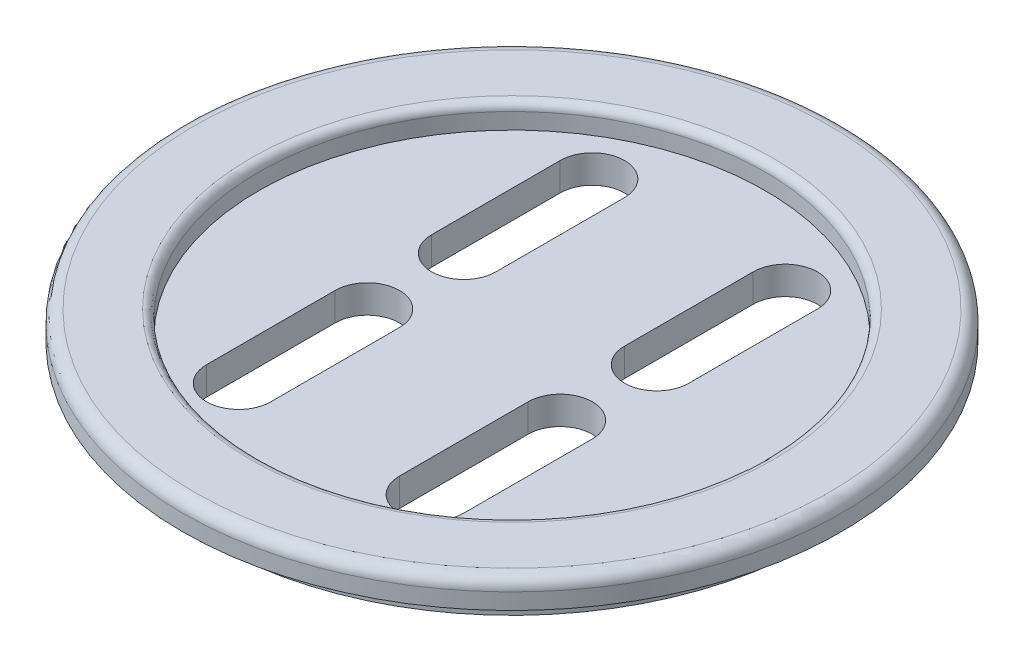
ISO-10303-21;
HEADER;
FILE_DESCRIPTION(('STEP AP214'),'2;1');
FILE_NAME('part.step','',(''),(''),'','','');
FILE_SCHEMA(('AUTOMOTIVE_DESIGN { 1 0 10303 214 1 1 1 1 }'));
ENDSEC;
DATA;
#1=APPLICATION_CONTEXT('core data for automotive mechanical design processes');
#2=APPLICATION_PROTOCOL_DEFINITION('international standard','automotive_design',2000,#1);
#3=PRODUCT_CONTEXT('',#1,'mechanical');
#4=PRODUCT('Part','Part','',(#3));
#5=PRODUCT_RELATED_PRODUCT_CATEGORY('part','',(#4));
#6=PRODUCT_DEFINITION_FORMATION('','',#4);
#7=PRODUCT_DEFINITION_CONTEXT('part definition',#1,'design');
#8=PRODUCT_DEFINITION('design','',#6,#7);
#9=PRODUCT_DEFINITION_SHAPE('','',#8);
#10=(LENGTH_UNIT() NAMED_UNIT(*) SI_UNIT(.MILLI.,.METRE.));
#11=(NAMED_UNIT(*) PLANE_ANGLE_UNIT() SI_UNIT($,.RADIAN.));
#12=(NAMED_UNIT(*) SI_UNIT($,.STERADIAN.) SOLID_ANGLE_UNIT());
#13=UNCERTAINTY_MEASURE_WITH_UNIT(LENGTH_MEASURE(1.E-05),#10,'distance_accuracy_value','');
#14=(GEOMETRIC_REPRESENTATION_CONTEXT(3) GLOBAL_UNCERTAINTY_ASSIGNED_CONTEXT((#13)) GLOBAL_UNIT_ASSIGNED_CONTEXT((#10,
#11,#12)) REPRESENTATION_CONTEXT('',''));
#15=CARTESIAN_POINT('',(0.,0.,0.));
#16=DIRECTION('',(0.,0.,1.));
#17=DIRECTION('',(1.,0.,0.));
#18=AXIS2_PLACEMENT_3D('',#15,#16,#17);
#19=CARTESIAN_POINT('',(160.,-30.,220.));
#20=DIRECTION('',(1.,0.,0.));
#21=DIRECTION('',(0.,0.,-1.));
#22=AXIS2_PLACEMENT_3D('',#19,#20,#21);
#23=PLANE('',#22);
#24=DIRECTION('',(0.,0.,1.));
#25=VECTOR('',#24,1.);
#26=CARTESIAN_POINT('',(160.,5.00000000000015,220.));
#27=LINE('',#26,#25);
#28=CARTESIAN_POINT('',(160.,5.00000000000015,60.));
#29=VERTEX_POINT('',#28);
#30=CARTESIAN_POINT('',(160.,5.00000000000015,220.));
#31=VERTEX_POINT('',#30);
#32=EDGE_CURVE('E296',#29,#31,#27,.T.);
#33=ORIENTED_EDGE('',*,*,#32,.F.);
#34=DIRECTION('',(0.,1.,0.));
#35=VECTOR('',#34,1.);
#36=CARTESIAN_POINT('',(160.,-30.,60.));
#37=LINE('',#36,#35);
#38=CARTESIAN_POINT('',(160.,-30.,60.));
#39=VERTEX_POINT('',#38);
#40=EDGE_CURVE('E201',#39,#29,#37,.T.);
#41=ORIENTED_EDGE('',*,*,#40,.F.);
#42=DIRECTION('',(0.,0.,-1.));
#43=VECTOR('',#42,1.);
#44=CARTESIAN_POINT('',(160.,-30.,220.));
#45=LINE('',#44,#43);
#46=CARTESIAN_POINT('',(160.,-30.,220.));
#47=VERTEX_POINT('',#46);
#48=EDGE_CURVE('E188',#47,#39,#45,.T.);
#49=ORIENTED_EDGE('',*,*,#48,.F.);
#50=DIRECTION('',(0.,1.,0.));
#51=VECTOR('',#50,1.);
#52=CARTESIAN_POINT('',(160.,-30.,220.));
#53=LINE('',#52,#51);
#54=EDGE_CURVE('E202',#47,#31,#53,.T.);
#55=ORIENTED_EDGE('',*,*,#54,.T.);
#56=EDGE_LOOP('',(#33,#41,#49,#55));
#57=FACE_BOUND('',#56,.T.);
#58=ADVANCED_FACE('F33',(#57),#23,.F.);
#59=CARTESIAN_POINT('',(120.,-30.,220.));
#60=DIRECTION('',(0.,1.,0.));
#61=DIRECTION('',(0.,0.,1.));
#62=AXIS2_PLACEMENT_3D('',#59,#60,#61);
#63=CYLINDRICAL_SURFACE('',#62,39.9999999999999);
#64=CARTESIAN_POINT('',(120.,5.00000000000015,220.));
#65=DIRECTION('',(0.,1.,0.));
#66=DIRECTION('',(0.,0.,1.));
#67=AXIS2_PLACEMENT_3D('',#64,#65,#66);
#68=CIRCLE('',#67,39.9999999999999);
#69=CARTESIAN_POINT('',(80.0000000000001,5.00000000000015,220.));
#70=VERTEX_POINT('',#69);
#71=EDGE_CURVE('E298',#31,#70,#68,.F.);
#72=ORIENTED_EDGE('',*,*,#71,.F.);
#73=ORIENTED_EDGE('',*,*,#54,.F.);
#74=CARTESIAN_POINT('',(120.,-30.,220.));
#75=DIRECTION('',(0.,1.,0.));
#76=DIRECTION('',(0.,0.,1.));
#77=AXIS2_PLACEMENT_3D('',#74,#75,#76);
#78=CIRCLE('',#77,39.9999999999999);
#79=CARTESIAN_POINT('',(80.0000000000001,-30.,220.));
#80=VERTEX_POINT('',#79);
#81=EDGE_CURVE('E198',#80,#47,#78,.T.);
#82=ORIENTED_EDGE('',*,*,#81,.F.);
#83=DIRECTION('',(0.,1.,0.));
#84=VECTOR('',#83,1.);
#85=CARTESIAN_POINT('',(80.0000000000001,-30.,220.));
#86=LINE('',#85,#84);
#87=EDGE_CURVE('E206',#80,#70,#86,.T.);
#88=ORIENTED_EDGE('',*,*,#87,.T.);
#89=EDGE_LOOP('',(#72,#73,#82,#88));
#90=FACE_BOUND('',#89,.T.);
#91=ADVANCED_FACE('F240',(#90),#63,.F.);
#92=CARTESIAN_POINT('',(80.0000000000001,-30.,220.));
#93=DIRECTION('',(1.,0.,0.));
#94=DIRECTION('',(0.,0.,-1.));
#95=AXIS2_PLACEMENT_3D('',#92,#93,#94);
#96=PLANE('',#95);
#97=DIRECTION('',(0.,1.,0.));
#98=VECTOR('',#97,1.);
#99=CARTESIAN_POINT('',(80.0000000000001,-30.,60.));
#100=LINE('',#99,#98);
#101=CARTESIAN_POINT('',(80.0000000000001,-30.,60.));
#102=VERTEX_POINT('',#101);
#103=CARTESIAN_POINT('',(80.0000000000001,5.00000000000013,60.));
#104=VERTEX_POINT('',#103);
#105=EDGE_CURVE('E209',#102,#104,#100,.T.);
#106=ORIENTED_EDGE('',*,*,#105,.T.);
#107=DIRECTION('',(0.,0.,1.));
#108=VECTOR('',#107,1.);
#109=CARTESIAN_POINT('',(80.0000000000001,5.00000000000015,220.));
#110=LINE('',#109,#108);
#111=EDGE_CURVE('E48',#104,#70,#110,.T.);
#112=ORIENTED_EDGE('',*,*,#111,.T.);
#113=ORIENTED_EDGE('',*,*,#87,.F.);
#114=DIRECTION('',(0.,0.,-1.));
#115=VECTOR('',#114,1.);
#116=CARTESIAN_POINT('',(80.0000000000001,-30.,220.));
#117=LINE('',#116,#115);
#118=EDGE_CURVE('E195',#80,#102,#117,.T.);
#119=ORIENTED_EDGE('',*,*,#118,.T.);
#120=EDGE_LOOP('',(#106,#112,#113,#119));
#121=FACE_BOUND('',#120,.T.);
#122=ADVANCED_FACE('F246',(#121),#96,.T.);
#123=CARTESIAN_POINT('',(120.,-30.,60.));
#124=DIRECTION('',(0.,1.,0.));
#125=DIRECTION('',(0.,0.,1.));
#126=AXIS2_PLACEMENT_3D('',#123,#124,#125);
#127=CYLINDRICAL_SURFACE('',#126,40.);
#128=CARTESIAN_POINT('',(120.,5.00000000000015,60.));
#129=DIRECTION('',(0.,1.,0.));
#130=DIRECTION('',(0.,0.,1.));
#131=AXIS2_PLACEMENT_3D('',#128,#129,#130);
#132=CIRCLE('',#131,40.);
#133=EDGE_CURVE('E345',#104,#29,#132,.F.);
#134=ORIENTED_EDGE('',*,*,#133,.F.);
#135=ORIENTED_EDGE('',*,*,#105,.F.);
#136=CARTESIAN_POINT('',(120.,-30.,60.));
#137=DIRECTION('',(0.,1.,0.));
#138=DIRECTION('',(0.,0.,1.));
#139=AXIS2_PLACEMENT_3D('',#136,#137,#138);
#140=CIRCLE('',#139,40.);
#141=EDGE_CURVE('E191',#39,#102,#140,.T.);
#142=ORIENTED_EDGE('',*,*,#141,.F.);
#143=ORIENTED_EDGE('',*,*,#40,.T.);
#144=EDGE_LOOP('',(#134,#135,#142,#143));
#145=FACE_BOUND('',#144,.T.);
#146=ADVANCED_FACE('F252',(#145),#127,.F.);
#147=CARTESIAN_POINT('',(-160.,-30.,220.));
#148=DIRECTION('',(1.,0.,0.));
#149=DIRECTION('',(0.,0.,-1.));
#150=AXIS2_PLACEMENT_3D('',#147,#148,#149);
#151=PLANE('',#150);
#152=DIRECTION('',(0.,1.,0.));
#153=VECTOR('',#152,1.);
#154=CARTESIAN_POINT('',(-160.,-30.,60.));
#155=LINE('',#154,#153);
#156=CARTESIAN_POINT('',(-160.,-30.,60.));
#157=VERTEX_POINT('',#156);
#158=CARTESIAN_POINT('',(-160.,5.00000000000015,60.));
#159=VERTEX_POINT('',#158);
#160=EDGE_CURVE('E303',#157,#159,#155,.T.);
#161=ORIENTED_EDGE('',*,*,#160,.T.);
#162=DIRECTION('',(0.,0.,1.));
#163=VECTOR('',#162,1.);
#164=CARTESIAN_POINT('',(-160.,5.00000000000015,220.));
#165=LINE('',#164,#163);
#166=CARTESIAN_POINT('',(-160.,5.00000000000015,220.));
#167=VERTEX_POINT('',#166);
#168=EDGE_CURVE('E347',#159,#167,#165,.T.);
#169=ORIENTED_EDGE('',*,*,#168,.T.);
#170=DIRECTION('',(0.,1.,0.));
#171=VECTOR('',#170,1.);
#172=CARTESIAN_POINT('',(-160.,-30.,220.));
#173=LINE('',#172,#171);
#174=CARTESIAN_POINT('',(-160.,-30.,220.));
#175=VERTEX_POINT('',#174);
#176=EDGE_CURVE('E332',#175,#167,#173,.T.);
#177=ORIENTED_EDGE('',*,*,#176,.F.);
#178=DIRECTION('',(0.,0.,-1.));
#179=VECTOR('',#178,1.);
#180=CARTESIAN_POINT('',(-160.,-30.,220.));
#181=LINE('',#180,#179);
#182=EDGE_CURVE('E192',#175,#157,#181,.T.);
#183=ORIENTED_EDGE('',*,*,#182,.T.);
#184=EDGE_LOOP('',(#161,#169,#177,#183));
#185=FACE_BOUND('',#184,.T.);
#186=ADVANCED_FACE('F377',(#185),#151,.T.);
#187=CARTESIAN_POINT('',(-120.,-30.,60.));
#188=DIRECTION('',(0.,1.,0.));
#189=DIRECTION('',(0.,0.,1.));
#190=AXIS2_PLACEMENT_3D('',#187,#188,#189);
#191=CYLINDRICAL_SURFACE('',#190,40.);
#192=DIRECTION('',(0.,1.,0.));
#193=VECTOR('',#192,1.);
#194=CARTESIAN_POINT('',(-80.0000000000001,-30.,60.));
#195=LINE('',#194,#193);
#196=CARTESIAN_POINT('',(-80.0000000000001,-30.,60.));
#197=VERTEX_POINT('',#196);
#198=CARTESIAN_POINT('',(-80.,5.00000000000015,60.));
#199=VERTEX_POINT('',#198);
#200=EDGE_CURVE('E338',#197,#199,#195,.T.);
#201=ORIENTED_EDGE('',*,*,#200,.T.);
#202=CARTESIAN_POINT('',(-120.,5.00000000000015,60.));
#203=DIRECTION('',(0.,1.,0.));
#204=DIRECTION('',(0.,0.,1.));
#205=AXIS2_PLACEMENT_3D('',#202,#203,#204);
#206=CIRCLE('',#205,40.);
#207=EDGE_CURVE('E350',#199,#159,#206,.T.);
#208=ORIENTED_EDGE('',*,*,#207,.T.);
#209=ORIENTED_EDGE('',*,*,#160,.F.);
#210=CARTESIAN_POINT('',(-120.,-30.,60.));
#211=DIRECTION('',(0.,-1.,0.));
#212=DIRECTION('',(0.,0.,-1.));
#213=AXIS2_PLACEMENT_3D('',#210,#211,#212);
#214=CIRCLE('',#213,40.);
#215=EDGE_CURVE('E325',#157,#197,#214,.T.);
#216=ORIENTED_EDGE('',*,*,#215,.T.);
#217=EDGE_LOOP('',(#201,#208,#209,#216));
#218=FACE_BOUND('',#217,.T.);
#219=ADVANCED_FACE('F380',(#218),#191,.F.);
#220=CARTESIAN_POINT('',(-80.0000000000001,-30.,220.));
#221=DIRECTION('',(1.,0.,0.));
#222=DIRECTION('',(0.,0.,-1.));
#223=AXIS2_PLACEMENT_3D('',#220,#221,#222);
#224=PLANE('',#223);
#225=DIRECTION('',(0.,0.,1.));
#226=VECTOR('',#225,1.);
#227=CARTESIAN_POINT('',(-80.0000000000001,5.00000000000015,220.));
#228=LINE('',#227,#226);
#229=CARTESIAN_POINT('',(-80.0000000000001,5.00000000000013,220.));
#230=VERTEX_POINT('',#229);
#231=EDGE_CURVE('E56',#199,#230,#228,.T.);
#232=ORIENTED_EDGE('',*,*,#231,.F.);
#233=ORIENTED_EDGE('',*,*,#200,.F.);
#234=DIRECTION('',(0.,0.,-1.));
#235=VECTOR('',#234,1.);
#236=CARTESIAN_POINT('',(-80.0000000000001,-30.,220.));
#237=LINE('',#236,#235);
#238=CARTESIAN_POINT('',(-80.0000000000001,-30.,220.));
#239=VERTEX_POINT('',#238);
#240=EDGE_CURVE('E327',#239,#197,#237,.T.);
#241=ORIENTED_EDGE('',*,*,#240,.F.);
#242=DIRECTION('',(0.,1.,0.));
#243=VECTOR('',#242,1.);
#244=CARTESIAN_POINT('',(-80.0000000000001,-30.,220.));
#245=LINE('',#244,#243);
#246=EDGE_CURVE('E335',#239,#230,#245,.T.);
#247=ORIENTED_EDGE('',*,*,#246,.T.);
#248=EDGE_LOOP('',(#232,#233,#241,#247));
#249=FACE_BOUND('',#248,.T.);
#250=ADVANCED_FACE('F384',(#249),#224,.F.);
#251=CARTESIAN_POINT('',(-120.,-30.,220.));
#252=DIRECTION('',(0.,1.,0.));
#253=DIRECTION('',(0.,0.,1.));
#254=AXIS2_PLACEMENT_3D('',#251,#252,#253);
#255=CYLINDRICAL_SURFACE('',#254,39.9999999999999);
#256=ORIENTED_EDGE('',*,*,#176,.T.);
#257=CARTESIAN_POINT('',(-120.,5.00000000000015,220.));
#258=DIRECTION('',(0.,1.,0.));
#259=DIRECTION('',(0.,0.,1.));
#260=AXIS2_PLACEMENT_3D('',#257,#258,#259);
#261=CIRCLE('',#260,39.9999999999999);
#262=EDGE_CURVE('E354',#167,#230,#261,.T.);
#263=ORIENTED_EDGE('',*,*,#262,.T.);
#264=ORIENTED_EDGE('',*,*,#246,.F.);
#265=CARTESIAN_POINT('',(-120.,-30.,220.));
#266=DIRECTION('',(0.,-1.,0.));
#267=DIRECTION('',(0.,0.,-1.));
#268=AXIS2_PLACEMENT_3D('',#265,#266,#267);
#269=CIRCLE('',#268,39.9999999999999);
#270=EDGE_CURVE('E330',#239,#175,#269,.T.);
#271=ORIENTED_EDGE('',*,*,#270,.T.);
#272=EDGE_LOOP('',(#256,#263,#264,#271));
#273=FACE_BOUND('',#272,.T.);
#274=ADVANCED_FACE('F388',(#273),#255,.F.);
#275=CARTESIAN_POINT('',(-80.0000000000001,-30.,-220.));
#276=DIRECTION('',(-1.,0.,0.));
#277=DIRECTION('',(0.,0.,1.));
#278=AXIS2_PLACEMENT_3D('',#275,#276,#277);
#279=PLANE('',#278);
#280=DIRECTION('',(0.,1.,0.));
#281=VECTOR('',#280,1.);
#282=CARTESIAN_POINT('',(-80.0000000000001,-30.,-60.));
#283=LINE('',#282,#281);
#284=CARTESIAN_POINT('',(-80.0000000000001,-30.,-60.));
#285=VERTEX_POINT('',#284);
#286=CARTESIAN_POINT('',(-80.0000000000001,5.00000000000015,-60.));
#287=VERTEX_POINT('',#286);
#288=EDGE_CURVE('E187',#285,#287,#283,.T.);
#289=ORIENTED_EDGE('',*,*,#288,.T.);
#290=DIRECTION('',(0.,0.,-1.));
#291=VECTOR('',#290,1.);
#292=CARTESIAN_POINT('',(-80.0000000000001,5.00000000000015,-220.));
#293=LINE('',#292,#291);
#294=CARTESIAN_POINT('',(-80.0000000000001,5.00000000000015,-220.));
#295=VERTEX_POINT('',#294);
#296=EDGE_CURVE('E356',#287,#295,#293,.T.);
#297=ORIENTED_EDGE('',*,*,#296,.T.);
#298=DIRECTION('',(0.,1.,0.));
#299=VECTOR('',#298,1.);
#300=CARTESIAN_POINT('',(-80.0000000000001,-30.,-220.));
#301=LINE('',#300,#299);
#302=CARTESIAN_POINT('',(-80.0000000000001,-30.,-220.));
#303=VERTEX_POINT('',#302);
#304=EDGE_CURVE('E313',#303,#295,#301,.T.);
#305=ORIENTED_EDGE('',*,*,#304,.F.);
#306=DIRECTION('',(0.,0.,1.));
#307=VECTOR('',#306,1.);
#308=CARTESIAN_POINT('',(-80.0000000000001,-30.,-220.));
#309=LINE('',#308,#307);
#310=EDGE_CURVE('E301',#303,#285,#309,.T.);
#311=ORIENTED_EDGE('',*,*,#310,.T.);
#312=EDGE_LOOP('',(#289,#297,#305,#311));
#313=FACE_BOUND('',#312,.T.);
#314=ADVANCED_FACE('F392',(#313),#279,.T.);
#315=CARTESIAN_POINT('',(-120.,-30.,-60.));
#316=DIRECTION('',(0.,1.,0.));
#317=DIRECTION('',(0.,0.,1.));
#318=AXIS2_PLACEMENT_3D('',#315,#316,#317);
#319=CYLINDRICAL_SURFACE('',#318,40.);
#320=CARTESIAN_POINT('',(-120.,5.00000000000015,-60.));
#321=DIRECTION('',(0.,1.,0.));
#322=DIRECTION('',(0.,0.,1.));
#323=AXIS2_PLACEMENT_3D('',#320,#321,#322);
#324=CIRCLE('',#323,40.);
#325=CARTESIAN_POINT('',(-160.,5.00000000000015,-60.));
#326=VERTEX_POINT('',#325);
#327=EDGE_CURVE('E359',#287,#326,#324,.F.);
#328=ORIENTED_EDGE('',*,*,#327,.F.);
#329=ORIENTED_EDGE('',*,*,#288,.F.);
#330=CARTESIAN_POINT('',(-120.,-30.,-60.));
#331=DIRECTION('',(0.,1.,0.));
#332=DIRECTION('',(0.,0.,1.));
#333=AXIS2_PLACEMENT_3D('',#330,#331,#332);
#334=CIRCLE('',#333,40.);
#335=CARTESIAN_POINT('',(-160.,-30.,-60.));
#336=VERTEX_POINT('',#335);
#337=EDGE_CURVE('E304',#336,#285,#334,.T.);
#338=ORIENTED_EDGE('',*,*,#337,.F.);
#339=DIRECTION('',(0.,1.,0.));
#340=VECTOR('',#339,1.);
#341=CARTESIAN_POINT('',(-160.,-30.,-60.));
#342=LINE('',#341,#340);
#343=EDGE_CURVE('E319',#336,#326,#342,.T.);
#344=ORIENTED_EDGE('',*,*,#343,.T.);
#345=EDGE_LOOP('',(#328,#329,#338,#344));
#346=FACE_BOUND('',#345,.T.);
#347=ADVANCED_FACE('F396',(#346),#319,.F.);
#348=CARTESIAN_POINT('',(-160.,-30.,-220.));
#349=DIRECTION('',(-1.,0.,0.));
#350=DIRECTION('',(0.,0.,1.));
#351=AXIS2_PLACEMENT_3D('',#348,#349,#350);
#352=PLANE('',#351);
#353=DIRECTION('',(0.,0.,-1.));
#354=VECTOR('',#353,1.);
#355=CARTESIAN_POINT('',(-160.,5.00000000000015,-220.));
#356=LINE('',#355,#354);
#357=CARTESIAN_POINT('',(-160.,5.00000000000013,-220.));
#358=VERTEX_POINT('',#357);
#359=EDGE_CURVE('E361',#326,#358,#356,.T.);
#360=ORIENTED_EDGE('',*,*,#359,.F.);
#361=ORIENTED_EDGE('',*,*,#343,.F.);
#362=DIRECTION('',(0.,0.,1.));
#363=VECTOR('',#362,1.);
#364=CARTESIAN_POINT('',(-160.,-30.,-220.));
#365=LINE('',#364,#363);
#366=CARTESIAN_POINT('',(-160.,-30.,-220.));
#367=VERTEX_POINT('',#366);
#368=EDGE_CURVE('E307',#367,#336,#365,.T.);
#369=ORIENTED_EDGE('',*,*,#368,.F.);
#370=DIRECTION('',(0.,1.,0.));
#371=VECTOR('',#370,1.);
#372=CARTESIAN_POINT('',(-160.,-30.,-220.));
#373=LINE('',#372,#371);
#374=EDGE_CURVE('E316',#367,#358,#373,.T.);
#375=ORIENTED_EDGE('',*,*,#374,.T.);
#376=EDGE_LOOP('',(#360,#361,#369,#375));
#377=FACE_BOUND('',#376,.T.);
#378=ADVANCED_FACE('F400',(#377),#352,.F.);
#379=CARTESIAN_POINT('',(-120.,-30.,-220.));
#380=DIRECTION('',(0.,1.,0.));
#381=DIRECTION('',(0.,0.,1.));
#382=AXIS2_PLACEMENT_3D('',#379,#380,#381);
#383=CYLINDRICAL_SURFACE('',#382,39.9999999999999);
#384=CARTESIAN_POINT('',(-120.,5.00000000000015,-220.));
#385=DIRECTION('',(0.,1.,0.));
#386=DIRECTION('',(0.,0.,1.));
#387=AXIS2_PLACEMENT_3D('',#384,#385,#386);
#388=CIRCLE('',#387,39.9999999999999);
#389=EDGE_CURVE('E166',#358,#295,#388,.F.);
#390=ORIENTED_EDGE('',*,*,#389,.F.);
#391=ORIENTED_EDGE('',*,*,#374,.F.);
#392=CARTESIAN_POINT('',(-120.,-30.,-220.));
#393=DIRECTION('',(0.,1.,0.));
#394=DIRECTION('',(0.,0.,1.));
#395=AXIS2_PLACEMENT_3D('',#392,#393,#394);
#396=CIRCLE('',#395,39.9999999999999);
#397=EDGE_CURVE('E310',#303,#367,#396,.T.);
#398=ORIENTED_EDGE('',*,*,#397,.F.);
#399=ORIENTED_EDGE('',*,*,#304,.T.);
#400=EDGE_LOOP('',(#390,#391,#398,#399));
#401=FACE_BOUND('',#400,.T.);
#402=ADVANCED_FACE('F404',(#401),#383,.F.);
#403=CARTESIAN_POINT('',(120.,-30.,-220.));
#404=DIRECTION('',(0.,1.,0.));
#405=DIRECTION('',(0.,0.,1.));
#406=AXIS2_PLACEMENT_3D('',#403,#404,#405);
#407=CYLINDRICAL_SURFACE('',#406,39.9999999999999);
#408=DIRECTION('',(0.,1.,0.));
#409=VECTOR('',#408,1.);
#410=CARTESIAN_POINT('',(160.,-30.,-220.));
#411=LINE('',#410,#409);
#412=CARTESIAN_POINT('',(160.,-30.,-220.));
#413=VERTEX_POINT('',#412);
#414=CARTESIAN_POINT('',(160.,5.00000000000015,-220.));
#415=VERTEX_POINT('',#414);
#416=EDGE_CURVE('E165',#413,#415,#411,.T.);
#417=ORIENTED_EDGE('',*,*,#416,.T.);
#418=CARTESIAN_POINT('',(120.,5.00000000000015,-220.));
#419=DIRECTION('',(0.,1.,0.));
#420=DIRECTION('',(0.,0.,1.));
#421=AXIS2_PLACEMENT_3D('',#418,#419,#420);
#422=CIRCLE('',#421,39.9999999999999);
#423=CARTESIAN_POINT('',(80.0000000000001,5.00000000000015,-220.));
#424=VERTEX_POINT('',#423);
#425=EDGE_CURVE('E149',#415,#424,#422,.T.);
#426=ORIENTED_EDGE('',*,*,#425,.T.);
#427=DIRECTION('',(0.,1.,0.));
#428=VECTOR('',#427,1.);
#429=CARTESIAN_POINT('',(80.0000000000001,-30.,-220.));
#430=LINE('',#429,#428);
#431=CARTESIAN_POINT('',(80.0000000000001,-30.,-220.));
#432=VERTEX_POINT('',#431);
#433=EDGE_CURVE('E162',#432,#424,#430,.T.);
#434=ORIENTED_EDGE('',*,*,#433,.F.);
#435=CARTESIAN_POINT('',(120.,-30.,-220.));
#436=DIRECTION('',(0.,-1.,0.));
#437=DIRECTION('',(0.,0.,-1.));
#438=AXIS2_PLACEMENT_3D('',#435,#436,#437);
#439=CIRCLE('',#438,39.9999999999999);
#440=EDGE_CURVE('E185',#432,#413,#439,.T.);
#441=ORIENTED_EDGE('',*,*,#440,.T.);
#442=EDGE_LOOP('',(#417,#426,#434,#441));
#443=FACE_BOUND('',#442,.T.);
#444=ADVANCED_FACE('F161',(#443),#407,.F.);
#445=CARTESIAN_POINT('',(160.,-30.,-220.));
#446=DIRECTION('',(-1.,0.,0.));
#447=DIRECTION('',(0.,0.,1.));
#448=AXIS2_PLACEMENT_3D('',#445,#446,#447);
#449=PLANE('',#448);
#450=DIRECTION('',(0.,1.,0.));
#451=VECTOR('',#450,1.);
#452=CARTESIAN_POINT('',(160.,-30.,-60.));
#453=LINE('',#452,#451);
#454=CARTESIAN_POINT('',(160.,-30.,-60.));
#455=VERTEX_POINT('',#454);
#456=CARTESIAN_POINT('',(160.,5.00000000000015,-60.));
#457=VERTEX_POINT('',#456);
#458=EDGE_CURVE('E177',#455,#457,#453,.T.);
#459=ORIENTED_EDGE('',*,*,#458,.T.);
#460=DIRECTION('',(0.,0.,-1.));
#461=VECTOR('',#460,1.);
#462=CARTESIAN_POINT('',(160.,5.00000000000015,-220.));
#463=LINE('',#462,#461);
#464=EDGE_CURVE('E167',#457,#415,#463,.T.);
#465=ORIENTED_EDGE('',*,*,#464,.T.);
#466=ORIENTED_EDGE('',*,*,#416,.F.);
#467=DIRECTION('',(0.,0.,1.));
#468=VECTOR('',#467,1.);
#469=CARTESIAN_POINT('',(160.,-30.,-220.));
#470=LINE('',#469,#468);
#471=EDGE_CURVE('E183',#413,#455,#470,.T.);
#472=ORIENTED_EDGE('',*,*,#471,.T.);
#473=EDGE_LOOP('',(#459,#465,#466,#472));
#474=FACE_BOUND('',#473,.T.);
#475=ADVANCED_FACE('F294',(#474),#449,.T.);
#476=CARTESIAN_POINT('',(120.,-30.,-60.));
#477=DIRECTION('',(0.,1.,0.));
#478=DIRECTION('',(0.,0.,1.));
#479=AXIS2_PLACEMENT_3D('',#476,#477,#478);
#480=CYLINDRICAL_SURFACE('',#479,40.);
#481=DIRECTION('',(0.,1.,0.));
#482=VECTOR('',#481,1.);
#483=CARTESIAN_POINT('',(80.,-30.,-60.));
#484=LINE('',#483,#482);
#485=CARTESIAN_POINT('',(80.,-30.,-60.));
#486=VERTEX_POINT('',#485);
#487=CARTESIAN_POINT('',(80.,5.00000000000013,-60.));
#488=VERTEX_POINT('',#487);
#489=EDGE_CURVE('E173',#486,#488,#484,.T.);
#490=ORIENTED_EDGE('',*,*,#489,.T.);
#491=CARTESIAN_POINT('',(120.,5.00000000000015,-60.));
#492=DIRECTION('',(0.,1.,0.));
#493=DIRECTION('',(0.,0.,1.));
#494=AXIS2_PLACEMENT_3D('',#491,#492,#493);
#495=CIRCLE('',#494,40.);
#496=EDGE_CURVE('E152',#488,#457,#495,.T.);
#497=ORIENTED_EDGE('',*,*,#496,.T.);
#498=ORIENTED_EDGE('',*,*,#458,.F.);
#499=CARTESIAN_POINT('',(120.,-30.,-60.));
#500=DIRECTION('',(0.,-1.,0.));
#501=DIRECTION('',(0.,0.,-1.));
#502=AXIS2_PLACEMENT_3D('',#499,#500,#501);
#503=CIRCLE('',#502,40.);
#504=EDGE_CURVE('E175',#455,#486,#503,.T.);
#505=ORIENTED_EDGE('',*,*,#504,.T.);
#506=EDGE_LOOP('',(#490,#497,#498,#505));
#507=FACE_BOUND('',#506,.T.);
#508=ADVANCED_FACE('F413',(#507),#480,.F.);
#509=CARTESIAN_POINT('',(80.0000000000001,-30.,-220.));
#510=DIRECTION('',(-1.,0.,0.));
#511=DIRECTION('',(0.,0.,1.));
#512=AXIS2_PLACEMENT_3D('',#509,#510,#511);
#513=PLANE('',#512);
#514=DIRECTION('',(0.,0.,-1.));
#515=VECTOR('',#514,1.);
#516=CARTESIAN_POINT('',(80.0000000000001,5.00000000000015,-220.));
#517=LINE('',#516,#515);
#518=EDGE_CURVE('E145',#488,#424,#517,.T.);
#519=ORIENTED_EDGE('',*,*,#518,.F.);
#520=ORIENTED_EDGE('',*,*,#489,.F.);
#521=DIRECTION('',(0.,0.,1.));
#522=VECTOR('',#521,1.);
#523=CARTESIAN_POINT('',(80.0000000000001,-30.,-220.));
#524=LINE('',#523,#522);
#525=EDGE_CURVE('E171',#432,#486,#524,.T.);
#526=ORIENTED_EDGE('',*,*,#525,.F.);
#527=ORIENTED_EDGE('',*,*,#433,.T.);
#528=EDGE_LOOP('',(#519,#520,#526,#527));
#529=FACE_BOUND('',#528,.T.);
#530=ADVANCED_FACE('F169',(#529),#513,.F.);
#531=CARTESIAN_POINT('',(0.,-30.,0.));
#532=DIRECTION('',(0.,1.,0.));
#533=DIRECTION('',(0.,0.,1.));
#534=AXIS2_PLACEMENT_3D('',#531,#532,#533);
#535=PLANE('',#534);
#536=ORIENTED_EDGE('',*,*,#310,.F.);
#537=ORIENTED_EDGE('',*,*,#397,.T.);
#538=ORIENTED_EDGE('',*,*,#368,.T.);
#539=ORIENTED_EDGE('',*,*,#337,.T.);
#540=EDGE_LOOP('',(#536,#537,#538,#539));
#541=FACE_BOUND('',#540,.T.);
#542=CARTESIAN_POINT('',(0.,-30.,0.));
#543=DIRECTION('',(0.,1.,0.));
#544=DIRECTION('',(0.,0.,1.));
#545=AXIS2_PLACEMENT_3D('',#542,#543,#544);
#546=CIRCLE('',#545,375.);
#547=CARTESIAN_POINT('',(0.,-30.,375.));
#548=VERTEX_POINT('',#547);
#549=EDGE_CURVE('E157',#548,#548,#546,.T.);
#550=ORIENTED_EDGE('',*,*,#549,.F.);
#551=EDGE_LOOP('',(#550));
#552=FACE_BOUND('',#551,.T.);
#553=ORIENTED_EDGE('',*,*,#81,.T.);
#554=ORIENTED_EDGE('',*,*,#48,.T.);
#555=ORIENTED_EDGE('',*,*,#141,.T.);
#556=ORIENTED_EDGE('',*,*,#118,.F.);
#557=EDGE_LOOP('',(#553,#554,#555,#556));
#558=FACE_BOUND('',#557,.T.);
#559=ORIENTED_EDGE('',*,*,#182,.F.);
#560=ORIENTED_EDGE('',*,*,#270,.F.);
#561=ORIENTED_EDGE('',*,*,#240,.T.);
#562=ORIENTED_EDGE('',*,*,#215,.F.);
#563=EDGE_LOOP('',(#559,#560,#561,#562));
#564=FACE_BOUND('',#563,.T.);
#565=ORIENTED_EDGE('',*,*,#440,.F.);
#566=ORIENTED_EDGE('',*,*,#525,.T.);
#567=ORIENTED_EDGE('',*,*,#504,.F.);
#568=ORIENTED_EDGE('',*,*,#471,.F.);
#569=EDGE_LOOP('',(#565,#566,#567,#568));
#570=FACE_BOUND('',#569,.T.);
#571=ADVANCED_FACE('F258',(#541,#552,#558,#564,#570),#535,.F.);
#572=CARTESIAN_POINT('',(0.,35.,0.));
#573=DIRECTION('',(0.,1.,0.));
#574=DIRECTION('',(0.,0.,1.));
#575=AXIS2_PLACEMENT_3D('',#572,#573,#574);
#576=PLANE('',#575);
#577=CARTESIAN_POINT('',(0.,35.,0.));
#578=DIRECTION('',(0.,1.,0.));
#579=DIRECTION('',(0.,0.,1.));
#580=AXIS2_PLACEMENT_3D('',#577,#578,#579);
#581=CIRCLE('',#580,325.);
#582=CARTESIAN_POINT('',(0.,35.,325.));
#583=VERTEX_POINT('',#582);
#584=EDGE_CURVE('E11',#583,#583,#581,.F.);
#585=ORIENTED_EDGE('',*,*,#584,.T.);
#586=EDGE_LOOP('',(#585));
#587=FACE_BOUND('',#586,.T.);
#588=CARTESIAN_POINT('',(0.,35.,0.));
#589=DIRECTION('',(0.,1.,0.));
#590=DIRECTION('',(0.,0.,1.));
#591=AXIS2_PLACEMENT_3D('',#588,#589,#590);
#592=CIRCLE('',#591,395.);
#593=CARTESIAN_POINT('',(0.,35.,395.));
#594=VERTEX_POINT('',#593);
#595=EDGE_CURVE('E156',#594,#594,#592,.T.);
#596=ORIENTED_EDGE('',*,*,#595,.T.);
#597=EDGE_LOOP('',(#596));
#598=FACE_BOUND('',#597,.T.);
#599=ADVANCED_FACE('F254',(#587,#598),#576,.T.);
#600=CARTESIAN_POINT('',(0.,-30.,0.));
#601=DIRECTION('',(0.,1.,0.));
#602=DIRECTION('',(0.,0.,1.));
#603=AXIS2_PLACEMENT_3D('',#600,#601,#602);
#604=CYLINDRICAL_SURFACE('',#603,375.);
#605=ORIENTED_EDGE('',*,*,#549,.T.);
#606=EDGE_LOOP('',(#605));
#607=FACE_BOUND('',#606,.T.);
#608=CARTESIAN_POINT('',(0.,0.,0.));
#609=DIRECTION('',(0.,1.,0.));
#610=DIRECTION('',(0.,0.,1.));
#611=AXIS2_PLACEMENT_3D('',#608,#609,#610);
#612=CIRCLE('',#611,375.);
#613=CARTESIAN_POINT('',(0.,0.,375.));
#614=VERTEX_POINT('',#613);
#615=EDGE_CURVE('E216',#614,#614,#612,.T.);
#616=ORIENTED_EDGE('',*,*,#615,.F.);
#617=EDGE_LOOP('',(#616));
#618=FACE_BOUND('',#617,.T.);
#619=ADVANCED_FACE('F257',(#607,#618),#604,.T.);
#620=CARTESIAN_POINT('',(0.,35.,0.));
#621=DIRECTION('',(0.,-1.,0.));
#622=DIRECTION('',(0.,0.,-1.));
#623=AXIS2_PLACEMENT_3D('',#620,#621,#622);
#624=CYLINDRICAL_SURFACE('',#623,410.);
#625=CARTESIAN_POINT('',(0.,20.,0.));
#626=DIRECTION('',(0.,1.,0.));
#627=DIRECTION('',(0.,0.,1.));
#628=AXIS2_PLACEMENT_3D('',#625,#626,#627);
#629=CIRCLE('',#628,410.);
#630=CARTESIAN_POINT('',(0.,20.,410.));
#631=VERTEX_POINT('',#630);
#632=EDGE_CURVE('E223',#631,#631,#629,.F.);
#633=ORIENTED_EDGE('',*,*,#632,.T.);
#634=EDGE_LOOP('',(#633));
#635=FACE_BOUND('',#634,.T.);
#636=CARTESIAN_POINT('',(0.,0.,0.));
#637=DIRECTION('',(0.,1.,0.));
#638=DIRECTION('',(0.,0.,1.));
#639=AXIS2_PLACEMENT_3D('',#636,#637,#638);
#640=CIRCLE('',#639,410.);
#641=CARTESIAN_POINT('',(0.,0.,410.));
#642=VERTEX_POINT('',#641);
#643=EDGE_CURVE('E205',#642,#642,#640,.T.);
#644=ORIENTED_EDGE('',*,*,#643,.T.);
#645=EDGE_LOOP('',(#644));
#646=FACE_BOUND('',#645,.T.);
#647=ADVANCED_FACE('F263',(#635,#646),#624,.T.);
#648=CARTESIAN_POINT('',(0.,0.,0.));
#649=DIRECTION('',(0.,1.,0.));
#650=DIRECTION('',(0.,0.,1.));
#651=AXIS2_PLACEMENT_3D('',#648,#649,#650);
#652=PLANE('',#651);
#653=ORIENTED_EDGE('',*,*,#615,.T.);
#654=EDGE_LOOP('',(#653));
#655=FACE_BOUND('',#654,.T.);
#656=ORIENTED_EDGE('',*,*,#643,.F.);
#657=EDGE_LOOP('',(#656));
#658=FACE_BOUND('',#657,.T.);
#659=ADVANCED_FACE('F260',(#655,#658),#652,.F.);
#660=CARTESIAN_POINT('',(0.,5.00000000000014,0.));
#661=DIRECTION('',(0.,1.,0.));
#662=DIRECTION('',(0.,0.,1.));
#663=AXIS2_PLACEMENT_3D('',#660,#661,#662);
#664=PLANE('',#663);
#665=CARTESIAN_POINT('',(0.,5.00000000000014,0.));
#666=DIRECTION('',(0.,1.,0.));
#667=DIRECTION('',(0.,0.,1.));
#668=AXIS2_PLACEMENT_3D('',#665,#666,#667);
#669=CIRCLE('',#668,315.);
#670=CARTESIAN_POINT('',(0.,5.00000000000014,315.));
#671=VERTEX_POINT('',#670);
#672=EDGE_CURVE('E366',#671,#671,#669,.T.);
#673=ORIENTED_EDGE('',*,*,#672,.T.);
#674=EDGE_LOOP('',(#673));
#675=FACE_BOUND('',#674,.T.);
#676=ORIENTED_EDGE('',*,*,#464,.F.);
#677=ORIENTED_EDGE('',*,*,#496,.F.);
#678=ORIENTED_EDGE('',*,*,#518,.T.);
#679=ORIENTED_EDGE('',*,*,#425,.F.);
#680=EDGE_LOOP('',(#676,#677,#678,#679));
#681=FACE_BOUND('',#680,.T.);
#682=ORIENTED_EDGE('',*,*,#327,.T.);
#683=ORIENTED_EDGE('',*,*,#359,.T.);
#684=ORIENTED_EDGE('',*,*,#389,.T.);
#685=ORIENTED_EDGE('',*,*,#296,.F.);
#686=EDGE_LOOP('',(#682,#683,#684,#685));
#687=FACE_BOUND('',#686,.T.);
#688=ORIENTED_EDGE('',*,*,#207,.F.);
#689=ORIENTED_EDGE('',*,*,#231,.T.);
#690=ORIENTED_EDGE('',*,*,#262,.F.);
#691=ORIENTED_EDGE('',*,*,#168,.F.);
#692=EDGE_LOOP('',(#688,#689,#690,#691));
#693=FACE_BOUND('',#692,.T.);
#694=ORIENTED_EDGE('',*,*,#32,.T.);
#695=ORIENTED_EDGE('',*,*,#71,.T.);
#696=ORIENTED_EDGE('',*,*,#111,.F.);
#697=ORIENTED_EDGE('',*,*,#133,.T.);
#698=EDGE_LOOP('',(#694,#695,#696,#697));
#699=FACE_BOUND('',#698,.T.);
#700=ADVANCED_FACE('F147',(#675,#681,#687,#693,#699),#664,.T.);
#701=CARTESIAN_POINT('',(0.,5.00000000000014,0.));
#702=DIRECTION('',(0.,1.,0.));
#703=DIRECTION('',(0.,0.,1.));
#704=AXIS2_PLACEMENT_3D('',#701,#702,#703);
#705=CYLINDRICAL_SURFACE('',#704,315.);
#706=CARTESIAN_POINT('',(0.,25.,0.));
#707=DIRECTION('',(0.,1.,0.));
#708=DIRECTION('',(0.,0.,1.));
#709=AXIS2_PLACEMENT_3D('',#706,#707,#708);
#710=CIRCLE('',#709,315.);
#711=CARTESIAN_POINT('',(0.,25.,315.));
#712=VERTEX_POINT('',#711);
#713=EDGE_CURVE('E41',#712,#712,#710,.T.);
#714=ORIENTED_EDGE('',*,*,#713,.T.);
#715=EDGE_LOOP('',(#714));
#716=FACE_BOUND('',#715,.T.);
#717=ORIENTED_EDGE('',*,*,#672,.F.);
#718=EDGE_LOOP('',(#717));
#719=FACE_BOUND('',#718,.T.);
#720=ADVANCED_FACE('F228',(#716,#719),#705,.F.);
#721=CARTESIAN_POINT('',(0.,20.,0.));
#722=DIRECTION('',(0.,1.,0.));
#723=DIRECTION('',(0.,0.,1.));
#724=AXIS2_PLACEMENT_3D('',#721,#722,#723);
#725=TOROIDAL_SURFACE('',#724,395.,15.);
#726=ORIENTED_EDGE('',*,*,#632,.F.);
#727=EDGE_LOOP('',(#726));
#728=FACE_BOUND('',#727,.T.);
#729=ORIENTED_EDGE('',*,*,#595,.F.);
#730=EDGE_LOOP('',(#729));
#731=FACE_BOUND('',#730,.T.);
#732=ADVANCED_FACE('F232',(#728,#731),#725,.T.);
#733=CARTESIAN_POINT('',(0.,25.,0.));
#734=DIRECTION('',(0.,1.,0.));
#735=DIRECTION('',(0.,0.,1.));
#736=AXIS2_PLACEMENT_3D('',#733,#734,#735);
#737=TOROIDAL_SURFACE('',#736,325.,10.);
#738=ORIENTED_EDGE('',*,*,#584,.F.);
#739=EDGE_LOOP('',(#738));
#740=FACE_BOUND('',#739,.T.);
#741=ORIENTED_EDGE('',*,*,#713,.F.);
#742=EDGE_LOOP('',(#741));
#743=FACE_BOUND('',#742,.T.);
#744=ADVANCED_FACE('F35',(#740,#743),#737,.T.);
#745=CLOSED_SHELL('',(#58,#91,#122,#146,#186,#219,#250,#274,#314,#347,#378,#402,#444,#475,#508,
#530,#571,#599,#619,#647,#659,#700,#720,#732,#744));
#746=MANIFOLD_SOLID_BREP('B2',#745);
#747=ADVANCED_BREP_SHAPE_REPRESENTATION('',(#18,#746),#14);
#748=SHAPE_DEFINITION_REPRESENTATION(#9,#747);
ENDSEC;
END-ISO-10303-21;
